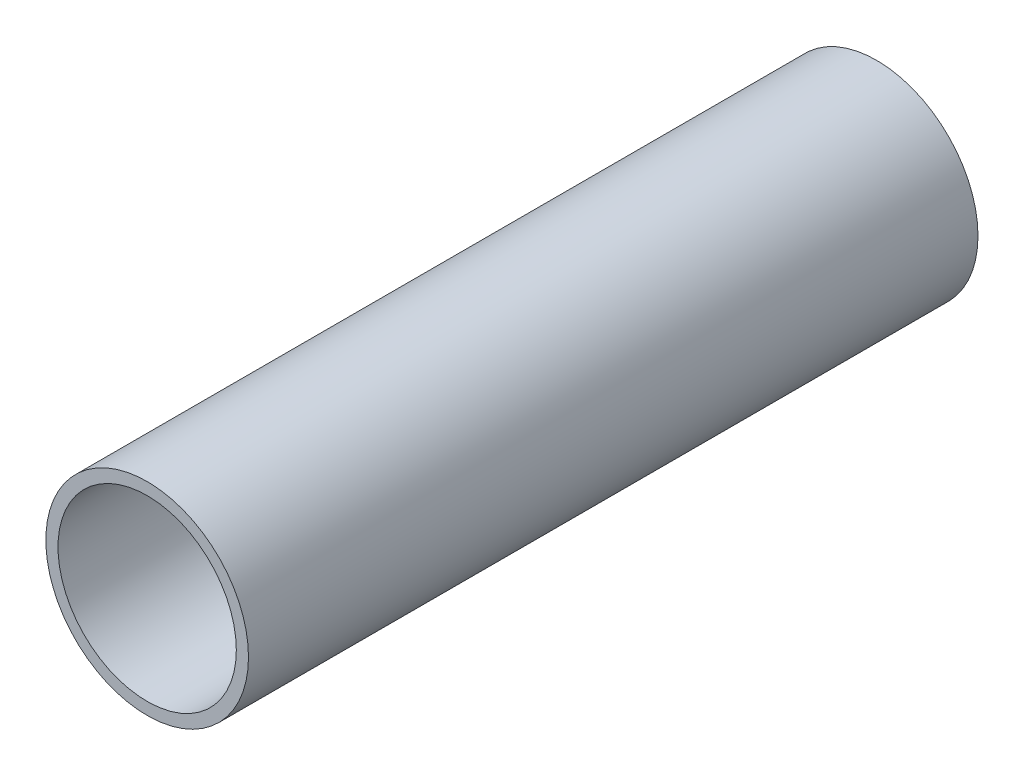
ISO-10303-21;
HEADER;
FILE_DESCRIPTION(('STEP AP214'),'2;1');
FILE_NAME('part.step','',(''),(''),'','','');
FILE_SCHEMA(('AUTOMOTIVE_DESIGN { 1 0 10303 214 1 1 1 1 }'));
ENDSEC;
DATA;
#1=APPLICATION_CONTEXT('core data for automotive mechanical design processes');
#2=APPLICATION_PROTOCOL_DEFINITION('international standard','automotive_design',2000,#1);
#3=PRODUCT_CONTEXT('',#1,'mechanical');
#4=PRODUCT('Part','Part','',(#3));
#5=PRODUCT_RELATED_PRODUCT_CATEGORY('part','',(#4));
#6=PRODUCT_DEFINITION_FORMATION('','',#4);
#7=PRODUCT_DEFINITION_CONTEXT('part definition',#1,'design');
#8=PRODUCT_DEFINITION('design','',#6,#7);
#9=PRODUCT_DEFINITION_SHAPE('','',#8);
#10=(LENGTH_UNIT() NAMED_UNIT(*) SI_UNIT(.MILLI.,.METRE.));
#11=(NAMED_UNIT(*) PLANE_ANGLE_UNIT() SI_UNIT($,.RADIAN.));
#12=(NAMED_UNIT(*) SI_UNIT($,.STERADIAN.) SOLID_ANGLE_UNIT());
#13=UNCERTAINTY_MEASURE_WITH_UNIT(LENGTH_MEASURE(1.E-05),#10,'distance_accuracy_value','');
#14=(GEOMETRIC_REPRESENTATION_CONTEXT(3) GLOBAL_UNCERTAINTY_ASSIGNED_CONTEXT((#13)) GLOBAL_UNIT_ASSIGNED_CONTEXT((#10,
#11,#12)) REPRESENTATION_CONTEXT('',''));
#15=CARTESIAN_POINT('',(0.,0.,0.));
#16=DIRECTION('',(0.,0.,1.));
#17=DIRECTION('',(1.,0.,0.));
#18=AXIS2_PLACEMENT_3D('',#15,#16,#17);
#19=CARTESIAN_POINT('',(0.,0.,90.));
#20=DIRECTION('',(0.,0.,1.));
#21=DIRECTION('',(1.,0.,0.));
#22=AXIS2_PLACEMENT_3D('',#19,#20,#21);
#23=PLANE('',#22);
#24=CARTESIAN_POINT('',(0.,0.,90.));
#25=DIRECTION('',(0.,0.,1.));
#26=DIRECTION('',(1.,0.,0.));
#27=AXIS2_PLACEMENT_3D('',#24,#25,#26);
#28=CIRCLE('',#27,12.5);
#29=CARTESIAN_POINT('',(12.5,0.,90.));
#30=VERTEX_POINT('',#29);
#31=EDGE_CURVE('E10',#30,#30,#28,.T.);
#32=ORIENTED_EDGE('',*,*,#31,.T.);
#33=EDGE_LOOP('',(#32));
#34=FACE_BOUND('',#33,.T.);
#35=CARTESIAN_POINT('',(0.,0.,90.));
#36=DIRECTION('',(0.,0.,1.));
#37=DIRECTION('',(1.,0.,0.));
#38=AXIS2_PLACEMENT_3D('',#35,#36,#37);
#39=CIRCLE('',#38,11.);
#40=CARTESIAN_POINT('',(11.,0.,90.));
#41=VERTEX_POINT('',#40);
#42=EDGE_CURVE('E48',#41,#41,#39,.T.);
#43=ORIENTED_EDGE('',*,*,#42,.F.);
#44=EDGE_LOOP('',(#43));
#45=FACE_BOUND('',#44,.T.);
#46=ADVANCED_FACE('F37',(#34,#45),#23,.T.);
#47=CARTESIAN_POINT('',(0.,0.,0.));
#48=DIRECTION('',(0.,0.,1.));
#49=DIRECTION('',(1.,0.,0.));
#50=AXIS2_PLACEMENT_3D('',#47,#48,#49);
#51=PLANE('',#50);
#52=CARTESIAN_POINT('',(0.,0.,0.));
#53=DIRECTION('',(0.,0.,1.));
#54=DIRECTION('',(1.,0.,0.));
#55=AXIS2_PLACEMENT_3D('',#52,#53,#54);
#56=CIRCLE('',#55,12.5);
#57=CARTESIAN_POINT('',(12.5,0.,0.));
#58=VERTEX_POINT('',#57);
#59=EDGE_CURVE('E41',#58,#58,#56,.T.);
#60=ORIENTED_EDGE('',*,*,#59,.F.);
#61=EDGE_LOOP('',(#60));
#62=FACE_BOUND('',#61,.T.);
#63=CARTESIAN_POINT('',(0.,0.,0.));
#64=DIRECTION('',(0.,0.,1.));
#65=DIRECTION('',(1.,0.,0.));
#66=AXIS2_PLACEMENT_3D('',#63,#64,#65);
#67=CIRCLE('',#66,11.);
#68=CARTESIAN_POINT('',(11.,0.,0.));
#69=VERTEX_POINT('',#68);
#70=EDGE_CURVE('E50',#69,#69,#67,.T.);
#71=ORIENTED_EDGE('',*,*,#70,.T.);
#72=EDGE_LOOP('',(#71));
#73=FACE_BOUND('',#72,.T.);
#74=ADVANCED_FACE('F60',(#62,#73),#51,.F.);
#75=CARTESIAN_POINT('',(0.,0.,90.));
#76=DIRECTION('',(0.,0.,-1.));
#77=DIRECTION('',(-1.,0.,0.));
#78=AXIS2_PLACEMENT_3D('',#75,#76,#77);
#79=CYLINDRICAL_SURFACE('',#78,12.5);
#80=ORIENTED_EDGE('',*,*,#31,.F.);
#81=EDGE_LOOP('',(#80));
#82=FACE_BOUND('',#81,.T.);
#83=ORIENTED_EDGE('',*,*,#59,.T.);
#84=EDGE_LOOP('',(#83));
#85=FACE_BOUND('',#84,.T.);
#86=ADVANCED_FACE('F39',(#82,#85),#79,.T.);
#87=CARTESIAN_POINT('',(0.,0.,90.));
#88=DIRECTION('',(0.,0.,-1.));
#89=DIRECTION('',(-1.,0.,0.));
#90=AXIS2_PLACEMENT_3D('',#87,#88,#89);
#91=CYLINDRICAL_SURFACE('',#90,11.);
#92=ORIENTED_EDGE('',*,*,#42,.T.);
#93=EDGE_LOOP('',(#92));
#94=FACE_BOUND('',#93,.T.);
#95=ORIENTED_EDGE('',*,*,#70,.F.);
#96=EDGE_LOOP('',(#95));
#97=FACE_BOUND('',#96,.T.);
#98=ADVANCED_FACE('F56',(#94,#97),#91,.F.);
#99=CLOSED_SHELL('',(#46,#74,#86,#98));
#100=MANIFOLD_SOLID_BREP('B2',#99);
#101=ADVANCED_BREP_SHAPE_REPRESENTATION('',(#18,#100),#14);
#102=SHAPE_DEFINITION_REPRESENTATION(#9,#101);
ENDSEC;
END-ISO-10303-21;
